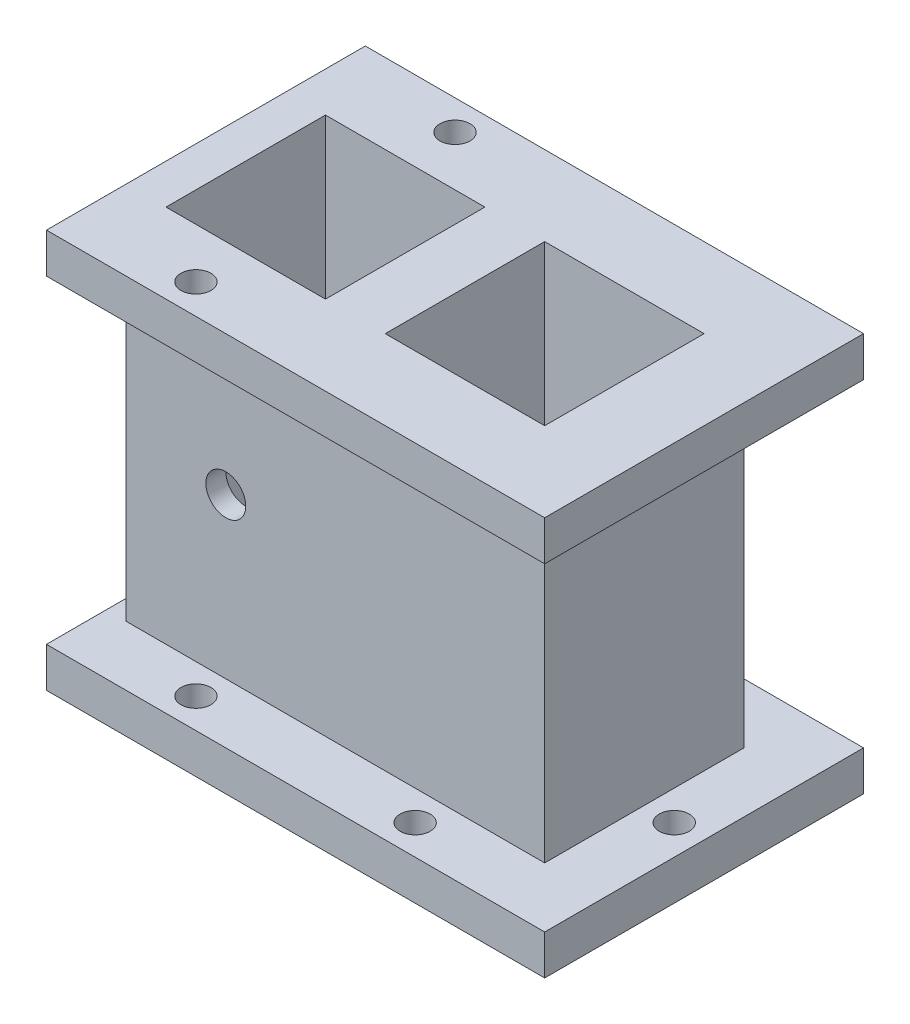
ISO-10303-21;
HEADER;
FILE_DESCRIPTION(('STEP AP214'),'2;1');
FILE_NAME('part.step','',(''),(''),'','','');
FILE_SCHEMA(('AUTOMOTIVE_DESIGN { 1 0 10303 214 1 1 1 1 }'));
ENDSEC;
DATA;
#1=APPLICATION_CONTEXT('core data for automotive mechanical design processes');
#2=APPLICATION_PROTOCOL_DEFINITION('international standard','automotive_design',2000,#1);
#3=PRODUCT_CONTEXT('',#1,'mechanical');
#4=PRODUCT('Part','Part','',(#3));
#5=PRODUCT_RELATED_PRODUCT_CATEGORY('part','',(#4));
#6=PRODUCT_DEFINITION_FORMATION('','',#4);
#7=PRODUCT_DEFINITION_CONTEXT('part definition',#1,'design');
#8=PRODUCT_DEFINITION('design','',#6,#7);
#9=PRODUCT_DEFINITION_SHAPE('','',#8);
#10=(LENGTH_UNIT() NAMED_UNIT(*) SI_UNIT(.MILLI.,.METRE.));
#11=(NAMED_UNIT(*) PLANE_ANGLE_UNIT() SI_UNIT($,.RADIAN.));
#12=(NAMED_UNIT(*) SI_UNIT($,.STERADIAN.) SOLID_ANGLE_UNIT());
#13=UNCERTAINTY_MEASURE_WITH_UNIT(LENGTH_MEASURE(1.E-05),#10,'distance_accuracy_value','');
#14=(GEOMETRIC_REPRESENTATION_CONTEXT(3) GLOBAL_UNCERTAINTY_ASSIGNED_CONTEXT((#13)) GLOBAL_UNIT_ASSIGNED_CONTEXT((#10,
#11,#12)) REPRESENTATION_CONTEXT('',''));
#15=CARTESIAN_POINT('',(0.,0.,0.));
#16=DIRECTION('',(0.,0.,1.));
#17=DIRECTION('',(1.,0.,0.));
#18=AXIS2_PLACEMENT_3D('',#15,#16,#17);
#19=CARTESIAN_POINT('',(0.0197787807074528,5.83942832277559,0.));
#20=DIRECTION('',(0.,1.,0.));
#21=DIRECTION('',(0.,0.,1.));
#22=AXIS2_PLACEMENT_3D('',#19,#20,#21);
#23=PLANE('',#22);
#24=CARTESIAN_POINT('',(-21.0304712192926,5.83942832277559,-21.05025));
#25=DIRECTION('',(0.,1.,0.));
#26=DIRECTION('',(0.,0.,1.));
#27=AXIS2_PLACEMENT_3D('',#24,#25,#26);
#28=CIRCLE('',#27,2.435352);
#29=CARTESIAN_POINT('',(-21.0304712192926,5.83942832277559,-18.614898));
#30=VERTEX_POINT('',#29);
#31=EDGE_CURVE('E355',#30,#30,#28,.F.);
#32=ORIENTED_EDGE('',*,*,#31,.T.);
#33=EDGE_LOOP('',(#32));
#34=FACE_BOUND('',#33,.T.);
#35=CARTESIAN_POINT('',(-21.0304712192926,5.83942832277559,21.05025));
#36=DIRECTION('',(0.,1.,0.));
#37=DIRECTION('',(0.,0.,1.));
#38=AXIS2_PLACEMENT_3D('',#35,#36,#37);
#39=CIRCLE('',#38,2.435352);
#40=CARTESIAN_POINT('',(-21.0304712192926,5.83942832277559,23.485602));
#41=VERTEX_POINT('',#40);
#42=EDGE_CURVE('E342',#41,#41,#39,.T.);
#43=ORIENTED_EDGE('',*,*,#42,.F.);
#44=EDGE_LOOP('',(#43));
#45=FACE_BOUND('',#44,.T.);
#46=CARTESIAN_POINT('',(14.5930287807074,5.83942832277559,-21.05025));
#47=DIRECTION('',(0.,1.,0.));
#48=DIRECTION('',(1.,0.,0.));
#49=AXIS2_PLACEMENT_3D('',#46,#47,#48);
#50=CIRCLE('',#49,2.43535200000001);
#51=CARTESIAN_POINT('',(17.0283807807074,5.83942832277559,-21.05025));
#52=VERTEX_POINT('',#51);
#53=EDGE_CURVE('E363',#52,#52,#50,.T.);
#54=ORIENTED_EDGE('',*,*,#53,.F.);
#55=EDGE_LOOP('',(#54));
#56=FACE_BOUND('',#55,.T.);
#57=CARTESIAN_POINT('',(14.5930287807077,5.83942832277559,21.05025));
#58=DIRECTION('',(0.,1.,0.));
#59=DIRECTION('',(-1.,0.,0.));
#60=AXIS2_PLACEMENT_3D('',#57,#58,#59);
#61=CIRCLE('',#60,2.43535200000001);
#62=CARTESIAN_POINT('',(12.1576767807077,5.83942832277559,21.05025));
#63=VERTEX_POINT('',#62);
#64=EDGE_CURVE('E347',#63,#63,#61,.T.);
#65=ORIENTED_EDGE('',*,*,#64,.F.);
#66=EDGE_LOOP('',(#65));
#67=FACE_BOUND('',#66,.T.);
#68=CARTESIAN_POINT('',(35.6432787807074,5.83942832277559,0.));
#69=DIRECTION('',(0.,1.,0.));
#70=DIRECTION('',(0.,0.,1.));
#71=AXIS2_PLACEMENT_3D('',#68,#69,#70);
#72=CIRCLE('',#71,2.43535200000001);
#73=CARTESIAN_POINT('',(35.6432787807074,5.83942832277559,2.43535200000001));
#74=VERTEX_POINT('',#73);
#75=EDGE_CURVE('E362',#74,#74,#72,.T.);
#76=ORIENTED_EDGE('',*,*,#75,.F.);
#77=EDGE_LOOP('',(#76));
#78=FACE_BOUND('',#77,.T.);
#79=DIRECTION('',(1.,0.,0.));
#80=VECTOR('',#79,1.);
#81=CARTESIAN_POINT('',(-40.4614712192926,5.83942832277559,25.908));
#82=LINE('',#81,#80);
#83=CARTESIAN_POINT('',(-40.4614712192926,5.83942832277559,25.908));
#84=VERTEX_POINT('',#83);
#85=CARTESIAN_POINT('',(40.5010287807074,5.83942832277559,25.908));
#86=VERTEX_POINT('',#85);
#87=EDGE_CURVE('E309',#84,#86,#82,.T.);
#88=ORIENTED_EDGE('',*,*,#87,.T.);
#89=DIRECTION('',(0.,0.,-1.));
#90=VECTOR('',#89,1.);
#91=CARTESIAN_POINT('',(40.5010287807074,5.83942832277559,25.908));
#92=LINE('',#91,#90);
#93=CARTESIAN_POINT('',(40.5010287807074,5.83942832277559,-25.908));
#94=VERTEX_POINT('',#93);
#95=EDGE_CURVE('E312',#86,#94,#92,.T.);
#96=ORIENTED_EDGE('',*,*,#95,.T.);
#97=DIRECTION('',(1.,0.,0.));
#98=VECTOR('',#97,1.);
#99=CARTESIAN_POINT('',(-40.4614712192926,5.83942832277559,-25.908));
#100=LINE('',#99,#98);
#101=CARTESIAN_POINT('',(-40.4614712192926,5.83942832277559,-25.908));
#102=VERTEX_POINT('',#101);
#103=EDGE_CURVE('E315',#102,#94,#100,.T.);
#104=ORIENTED_EDGE('',*,*,#103,.F.);
#105=DIRECTION('',(0.,0.,-1.));
#106=VECTOR('',#105,1.);
#107=CARTESIAN_POINT('',(-40.4614712192926,5.83942832277559,25.908));
#108=LINE('',#107,#106);
#109=EDGE_CURVE('E318',#84,#102,#108,.T.);
#110=ORIENTED_EDGE('',*,*,#109,.F.);
#111=EDGE_LOOP('',(#88,#96,#104,#110));
#112=FACE_BOUND('',#111,.T.);
#113=DIRECTION('',(1.,0.,0.));
#114=VECTOR('',#113,1.);
#115=CARTESIAN_POINT('',(-37.2229712192926,5.83942832277559,16.1925));
#116=LINE('',#115,#114);
#117=CARTESIAN_POINT('',(-37.2229712192926,5.83942832277559,16.1925));
#118=VERTEX_POINT('',#117);
#119=CARTESIAN_POINT('',(30.7855287807075,5.83942832277559,16.1925));
#120=VERTEX_POINT('',#119);
#121=EDGE_CURVE('E293',#118,#120,#116,.T.);
#122=ORIENTED_EDGE('',*,*,#121,.F.);
#123=DIRECTION('',(0.,0.,1.));
#124=VECTOR('',#123,1.);
#125=CARTESIAN_POINT('',(-37.2229712192926,5.83942832277559,16.1925));
#126=LINE('',#125,#124);
#127=CARTESIAN_POINT('',(-37.2229712192926,5.83942832277559,-16.1925));
#128=VERTEX_POINT('',#127);
#129=EDGE_CURVE('E276',#128,#118,#126,.T.);
#130=ORIENTED_EDGE('',*,*,#129,.F.);
#131=DIRECTION('',(-1.,0.,0.));
#132=VECTOR('',#131,1.);
#133=CARTESIAN_POINT('',(-37.2229712192926,5.83942832277559,-16.1925));
#134=LINE('',#133,#132);
#135=CARTESIAN_POINT('',(30.7855287807075,5.83942832277559,-16.1925));
#136=VERTEX_POINT('',#135);
#137=EDGE_CURVE('E281',#136,#128,#134,.T.);
#138=ORIENTED_EDGE('',*,*,#137,.F.);
#139=DIRECTION('',(0.,0.,-1.));
#140=VECTOR('',#139,1.);
#141=CARTESIAN_POINT('',(30.7855287807075,5.83942832277559,16.1925));
#142=LINE('',#141,#140);
#143=EDGE_CURVE('E295',#120,#136,#142,.T.);
#144=ORIENTED_EDGE('',*,*,#143,.F.);
#145=EDGE_LOOP('',(#122,#130,#138,#144));
#146=FACE_BOUND('',#145,.T.);
#147=ADVANCED_FACE('F36',(#34,#45,#56,#67,#78,#112,#146),#23,.T.);
#148=CARTESIAN_POINT('',(-40.4614712192926,5.83942832277559,25.908));
#149=DIRECTION('',(0.,0.,-1.));
#150=DIRECTION('',(-1.,0.,0.));
#151=AXIS2_PLACEMENT_3D('',#148,#149,#150);
#152=PLANE('',#151);
#153=DIRECTION('',(1.,0.,0.));
#154=VECTOR('',#153,1.);
#155=CARTESIAN_POINT('',(-40.4614712192926,-0.637571677224411,25.908));
#156=LINE('',#155,#154);
#157=CARTESIAN_POINT('',(-40.4614712192926,-0.637571677224411,25.908));
#158=VERTEX_POINT('',#157);
#159=CARTESIAN_POINT('',(40.5010287807074,-0.637571677224411,25.908));
#160=VERTEX_POINT('',#159);
#161=EDGE_CURVE('E308',#158,#160,#156,.T.);
#162=ORIENTED_EDGE('',*,*,#161,.T.);
#163=DIRECTION('',(0.,-1.,0.));
#164=VECTOR('',#163,1.);
#165=CARTESIAN_POINT('',(40.5010287807074,5.83942832277559,25.908));
#166=LINE('',#165,#164);
#167=EDGE_CURVE('E11',#86,#160,#166,.T.);
#168=ORIENTED_EDGE('',*,*,#167,.F.);
#169=ORIENTED_EDGE('',*,*,#87,.F.);
#170=DIRECTION('',(0.,-1.,0.));
#171=VECTOR('',#170,1.);
#172=CARTESIAN_POINT('',(-40.4614712192926,5.83942832277559,25.908));
#173=LINE('',#172,#171);
#174=EDGE_CURVE('E321',#84,#158,#173,.T.);
#175=ORIENTED_EDGE('',*,*,#174,.T.);
#176=EDGE_LOOP('',(#162,#168,#169,#175));
#177=FACE_BOUND('',#176,.T.);
#178=ADVANCED_FACE('F38',(#177),#152,.F.);
#179=CARTESIAN_POINT('',(40.5010287807074,5.83942832277559,25.908));
#180=DIRECTION('',(-1.,0.,0.));
#181=DIRECTION('',(0.,0.,1.));
#182=AXIS2_PLACEMENT_3D('',#179,#180,#181);
#183=PLANE('',#182);
#184=DIRECTION('',(0.,0.,-1.));
#185=VECTOR('',#184,1.);
#186=CARTESIAN_POINT('',(40.5010287807074,-0.637571677224411,25.908));
#187=LINE('',#186,#185);
#188=CARTESIAN_POINT('',(40.5010287807074,-0.637571677224411,-25.908));
#189=VERTEX_POINT('',#188);
#190=EDGE_CURVE('E324',#160,#189,#187,.T.);
#191=ORIENTED_EDGE('',*,*,#190,.T.);
#192=DIRECTION('',(0.,-1.,0.));
#193=VECTOR('',#192,1.);
#194=CARTESIAN_POINT('',(40.5010287807074,5.83942832277559,-25.908));
#195=LINE('',#194,#193);
#196=EDGE_CURVE('E45',#94,#189,#195,.T.);
#197=ORIENTED_EDGE('',*,*,#196,.F.);
#198=ORIENTED_EDGE('',*,*,#95,.F.);
#199=ORIENTED_EDGE('',*,*,#167,.T.);
#200=EDGE_LOOP('',(#191,#197,#198,#199));
#201=FACE_BOUND('',#200,.T.);
#202=ADVANCED_FACE('F410',(#201),#183,.F.);
#203=CARTESIAN_POINT('',(-40.4614712192926,5.83942832277559,-25.908));
#204=DIRECTION('',(0.,0.,-1.));
#205=DIRECTION('',(-1.,0.,0.));
#206=AXIS2_PLACEMENT_3D('',#203,#204,#205);
#207=PLANE('',#206);
#208=DIRECTION('',(1.,0.,0.));
#209=VECTOR('',#208,1.);
#210=CARTESIAN_POINT('',(-40.4614712192926,-0.637571677224411,-25.908));
#211=LINE('',#210,#209);
#212=CARTESIAN_POINT('',(-40.4614712192926,-0.637571677224411,-25.908));
#213=VERTEX_POINT('',#212);
#214=EDGE_CURVE('E327',#213,#189,#211,.T.);
#215=ORIENTED_EDGE('',*,*,#214,.F.);
#216=DIRECTION('',(0.,-1.,0.));
#217=VECTOR('',#216,1.);
#218=CARTESIAN_POINT('',(-40.4614712192926,5.83942832277559,-25.908));
#219=LINE('',#218,#217);
#220=EDGE_CURVE('E333',#102,#213,#219,.T.);
#221=ORIENTED_EDGE('',*,*,#220,.F.);
#222=ORIENTED_EDGE('',*,*,#103,.T.);
#223=ORIENTED_EDGE('',*,*,#196,.T.);
#224=EDGE_LOOP('',(#215,#221,#222,#223));
#225=FACE_BOUND('',#224,.T.);
#226=ADVANCED_FACE('F407',(#225),#207,.T.);
#227=CARTESIAN_POINT('',(-40.4614712192926,5.83942832277559,25.908));
#228=DIRECTION('',(-1.,0.,0.));
#229=DIRECTION('',(0.,0.,1.));
#230=AXIS2_PLACEMENT_3D('',#227,#228,#229);
#231=PLANE('',#230);
#232=DIRECTION('',(0.,0.,-1.));
#233=VECTOR('',#232,1.);
#234=CARTESIAN_POINT('',(-40.4614712192926,-0.637571677224411,25.908));
#235=LINE('',#234,#233);
#236=EDGE_CURVE('E313',#158,#213,#235,.T.);
#237=ORIENTED_EDGE('',*,*,#236,.F.);
#238=ORIENTED_EDGE('',*,*,#174,.F.);
#239=ORIENTED_EDGE('',*,*,#109,.T.);
#240=ORIENTED_EDGE('',*,*,#220,.T.);
#241=EDGE_LOOP('',(#237,#238,#239,#240));
#242=FACE_BOUND('',#241,.T.);
#243=ADVANCED_FACE('F392',(#242),#231,.T.);
#244=CARTESIAN_POINT('',(0.0197787807074528,-0.637571677224411,0.));
#245=DIRECTION('',(0.,1.,0.));
#246=DIRECTION('',(0.,0.,1.));
#247=AXIS2_PLACEMENT_3D('',#244,#245,#246);
#248=PLANE('',#247);
#249=CARTESIAN_POINT('',(-21.0304712192926,-0.637571677224411,-21.05025));
#250=DIRECTION('',(0.,-1.,0.));
#251=DIRECTION('',(0.,0.,-1.));
#252=AXIS2_PLACEMENT_3D('',#249,#250,#251);
#253=CIRCLE('',#252,2.435352);
#254=CARTESIAN_POINT('',(-21.0304712192926,-0.637571677224411,-23.485602));
#255=VERTEX_POINT('',#254);
#256=EDGE_CURVE('E729',#255,#255,#253,.T.);
#257=ORIENTED_EDGE('',*,*,#256,.F.);
#258=EDGE_LOOP('',(#257));
#259=FACE_BOUND('',#258,.T.);
#260=CARTESIAN_POINT('',(-21.0304712192926,-0.637571677224411,21.05025));
#261=DIRECTION('',(0.,1.,0.));
#262=DIRECTION('',(0.,0.,1.));
#263=AXIS2_PLACEMENT_3D('',#260,#261,#262);
#264=CIRCLE('',#263,2.435352);
#265=CARTESIAN_POINT('',(-21.0304712192926,-0.637571677224411,23.485602));
#266=VERTEX_POINT('',#265);
#267=EDGE_CURVE('E343',#266,#266,#264,.T.);
#268=ORIENTED_EDGE('',*,*,#267,.T.);
#269=EDGE_LOOP('',(#268));
#270=FACE_BOUND('',#269,.T.);
#271=CARTESIAN_POINT('',(14.5930287807074,-0.637571677224411,-21.05025));
#272=DIRECTION('',(0.,1.,0.));
#273=DIRECTION('',(1.,0.,0.));
#274=AXIS2_PLACEMENT_3D('',#271,#272,#273);
#275=CIRCLE('',#274,2.43535200000001);
#276=CARTESIAN_POINT('',(17.0283807807074,-0.637571677224411,-21.05025));
#277=VERTEX_POINT('',#276);
#278=EDGE_CURVE('E359',#277,#277,#275,.T.);
#279=ORIENTED_EDGE('',*,*,#278,.T.);
#280=EDGE_LOOP('',(#279));
#281=FACE_BOUND('',#280,.T.);
#282=CARTESIAN_POINT('',(14.5930287807077,-0.637571677224411,21.05025));
#283=DIRECTION('',(0.,1.,0.));
#284=DIRECTION('',(-1.,0.,0.));
#285=AXIS2_PLACEMENT_3D('',#282,#283,#284);
#286=CIRCLE('',#285,2.43535200000001);
#287=CARTESIAN_POINT('',(12.1576767807077,-0.637571677224411,21.05025));
#288=VERTEX_POINT('',#287);
#289=EDGE_CURVE('E366',#288,#288,#286,.T.);
#290=ORIENTED_EDGE('',*,*,#289,.T.);
#291=EDGE_LOOP('',(#290));
#292=FACE_BOUND('',#291,.T.);
#293=CARTESIAN_POINT('',(35.6432787807074,-0.637571677224411,0.));
#294=DIRECTION('',(0.,1.,0.));
#295=DIRECTION('',(0.,0.,1.));
#296=AXIS2_PLACEMENT_3D('',#293,#294,#295);
#297=CIRCLE('',#296,2.43535200000001);
#298=CARTESIAN_POINT('',(35.6432787807074,-0.637571677224411,2.43535200000001));
#299=VERTEX_POINT('',#298);
#300=EDGE_CURVE('E371',#299,#299,#297,.T.);
#301=ORIENTED_EDGE('',*,*,#300,.T.);
#302=EDGE_LOOP('',(#301));
#303=FACE_BOUND('',#302,.T.);
#304=DIRECTION('',(-1.,0.,0.));
#305=VECTOR('',#304,1.);
#306=CARTESIAN_POINT('',(-33.9844712192926,-0.637571677224411,-12.954));
#307=LINE('',#306,#305);
#308=CARTESIAN_POINT('',(-8.07647121929256,-0.637571677224411,-12.954));
#309=VERTEX_POINT('',#308);
#310=CARTESIAN_POINT('',(-33.9844712192926,-0.637571677224411,-12.954));
#311=VERTEX_POINT('',#310);
#312=EDGE_CURVE('E208',#309,#311,#307,.T.);
#313=ORIENTED_EDGE('',*,*,#312,.T.);
#314=DIRECTION('',(0.,0.,1.));
#315=VECTOR('',#314,1.);
#316=CARTESIAN_POINT('',(-33.9844712192926,-0.637571677224411,-12.954));
#317=LINE('',#316,#315);
#318=CARTESIAN_POINT('',(-33.9844712192926,-0.637571677224411,12.954));
#319=VERTEX_POINT('',#318);
#320=EDGE_CURVE('E199',#311,#319,#317,.T.);
#321=ORIENTED_EDGE('',*,*,#320,.T.);
#322=DIRECTION('',(1.,0.,0.));
#323=VECTOR('',#322,1.);
#324=CARTESIAN_POINT('',(-33.9844712192926,-0.637571677224411,12.954));
#325=LINE('',#324,#323);
#326=CARTESIAN_POINT('',(-8.07647121929256,-0.637571677224411,12.954));
#327=VERTEX_POINT('',#326);
#328=EDGE_CURVE('E205',#319,#327,#325,.T.);
#329=ORIENTED_EDGE('',*,*,#328,.T.);
#330=DIRECTION('',(0.,0.,-1.));
#331=VECTOR('',#330,1.);
#332=CARTESIAN_POINT('',(-8.07647121929256,-0.637571677224411,-12.954));
#333=LINE('',#332,#331);
#334=EDGE_CURVE('E181',#327,#309,#333,.T.);
#335=ORIENTED_EDGE('',*,*,#334,.T.);
#336=EDGE_LOOP('',(#313,#321,#329,#335));
#337=FACE_BOUND('',#336,.T.);
#338=DIRECTION('',(-1.,0.,0.));
#339=VECTOR('',#338,1.);
#340=CARTESIAN_POINT('',(1.63902878070744,-0.637571677224411,-12.954));
#341=LINE('',#340,#339);
#342=CARTESIAN_POINT('',(27.5470287807074,-0.637571677224411,-12.954));
#343=VERTEX_POINT('',#342);
#344=CARTESIAN_POINT('',(1.63902878070744,-0.637571677224411,-12.954));
#345=VERTEX_POINT('',#344);
#346=EDGE_CURVE('E233',#343,#345,#341,.T.);
#347=ORIENTED_EDGE('',*,*,#346,.T.);
#348=DIRECTION('',(0.,0.,1.));
#349=VECTOR('',#348,1.);
#350=CARTESIAN_POINT('',(1.63902878070744,-0.637571677224411,-12.954));
#351=LINE('',#350,#349);
#352=CARTESIAN_POINT('',(1.63902878070744,-0.637571677224411,12.954));
#353=VERTEX_POINT('',#352);
#354=EDGE_CURVE('E224',#345,#353,#351,.T.);
#355=ORIENTED_EDGE('',*,*,#354,.T.);
#356=DIRECTION('',(1.,0.,0.));
#357=VECTOR('',#356,1.);
#358=CARTESIAN_POINT('',(1.63902878070744,-0.637571677224411,12.954));
#359=LINE('',#358,#357);
#360=CARTESIAN_POINT('',(27.5470287807074,-0.637571677224411,12.954));
#361=VERTEX_POINT('',#360);
#362=EDGE_CURVE('E227',#353,#361,#359,.T.);
#363=ORIENTED_EDGE('',*,*,#362,.T.);
#364=DIRECTION('',(0.,0.,-1.));
#365=VECTOR('',#364,1.);
#366=CARTESIAN_POINT('',(27.5470287807074,-0.637571677224411,-12.954));
#367=LINE('',#366,#365);
#368=EDGE_CURVE('E230',#361,#343,#367,.T.);
#369=ORIENTED_EDGE('',*,*,#368,.T.);
#370=EDGE_LOOP('',(#347,#355,#363,#369));
#371=FACE_BOUND('',#370,.T.);
#372=ORIENTED_EDGE('',*,*,#161,.F.);
#373=ORIENTED_EDGE('',*,*,#236,.T.);
#374=ORIENTED_EDGE('',*,*,#214,.T.);
#375=ORIENTED_EDGE('',*,*,#190,.F.);
#376=EDGE_LOOP('',(#372,#373,#374,#375));
#377=FACE_BOUND('',#376,.T.);
#378=ADVANCED_FACE('F388',(#259,#270,#281,#292,#303,#337,#371,#377),#248,.F.);
#379=CARTESIAN_POINT('',(-37.2229712192926,57.6554283227756,16.1925));
#380=DIRECTION('',(1.,0.,0.));
#381=DIRECTION('',(0.,0.,-1.));
#382=AXIS2_PLACEMENT_3D('',#379,#380,#381);
#383=PLANE('',#382);
#384=ORIENTED_EDGE('',*,*,#129,.T.);
#385=DIRECTION('',(0.,-1.,0.));
#386=VECTOR('',#385,1.);
#387=CARTESIAN_POINT('',(-37.2229712192926,57.6554283227756,16.1925));
#388=LINE('',#387,#386);
#389=CARTESIAN_POINT('',(-37.2229712192926,57.6554283227756,16.1925));
#390=VERTEX_POINT('',#389);
#391=EDGE_CURVE('E306',#390,#118,#388,.T.);
#392=ORIENTED_EDGE('',*,*,#391,.F.);
#393=DIRECTION('',(0.,0.,1.));
#394=VECTOR('',#393,1.);
#395=CARTESIAN_POINT('',(-37.2229712192926,57.6554283227756,16.1925));
#396=LINE('',#395,#394);
#397=CARTESIAN_POINT('',(-37.2229712192926,57.6554283227756,-16.1925));
#398=VERTEX_POINT('',#397);
#399=EDGE_CURVE('E277',#398,#390,#396,.T.);
#400=ORIENTED_EDGE('',*,*,#399,.F.);
#401=DIRECTION('',(0.,-1.,0.));
#402=VECTOR('',#401,1.);
#403=CARTESIAN_POINT('',(-37.2229712192926,57.6554283227756,-16.1925));
#404=LINE('',#403,#402);
#405=EDGE_CURVE('E290',#398,#128,#404,.T.);
#406=ORIENTED_EDGE('',*,*,#405,.T.);
#407=EDGE_LOOP('',(#384,#392,#400,#406));
#408=FACE_BOUND('',#407,.T.);
#409=ADVANCED_FACE('F391',(#408),#383,.F.);
#410=CARTESIAN_POINT('',(-37.2229712192926,57.6554283227756,16.1925));
#411=DIRECTION('',(0.,0.,-1.));
#412=DIRECTION('',(-1.,0.,0.));
#413=AXIS2_PLACEMENT_3D('',#410,#411,#412);
#414=PLANE('',#413);
#415=CARTESIAN_POINT('',(-21.0304712192926,31.7474283227756,16.1925));
#416=DIRECTION('',(0.,0.,1.));
#417=DIRECTION('',(1.,0.,0.));
#418=AXIS2_PLACEMENT_3D('',#415,#416,#417);
#419=CIRCLE('',#418,3.2385);
#420=CARTESIAN_POINT('',(-17.7919712192926,31.7474283227756,16.1925));
#421=VERTEX_POINT('',#420);
#422=EDGE_CURVE('E339',#421,#421,#419,.T.);
#423=ORIENTED_EDGE('',*,*,#422,.F.);
#424=EDGE_LOOP('',(#423));
#425=FACE_BOUND('',#424,.T.);
#426=ORIENTED_EDGE('',*,*,#121,.T.);
#427=DIRECTION('',(0.,-1.,0.));
#428=VECTOR('',#427,1.);
#429=CARTESIAN_POINT('',(30.7855287807075,57.6554283227756,16.1925));
#430=LINE('',#429,#428);
#431=CARTESIAN_POINT('',(30.7855287807075,57.6554283227756,16.1925));
#432=VERTEX_POINT('',#431);
#433=EDGE_CURVE('E303',#432,#120,#430,.T.);
#434=ORIENTED_EDGE('',*,*,#433,.F.);
#435=DIRECTION('',(1.,0.,0.));
#436=VECTOR('',#435,1.);
#437=CARTESIAN_POINT('',(-37.2229712192926,57.6554283227756,16.1925));
#438=LINE('',#437,#436);
#439=EDGE_CURVE('E280',#390,#432,#438,.T.);
#440=ORIENTED_EDGE('',*,*,#439,.F.);
#441=ORIENTED_EDGE('',*,*,#391,.T.);
#442=EDGE_LOOP('',(#426,#434,#440,#441));
#443=FACE_BOUND('',#442,.T.);
#444=ADVANCED_FACE('F421',(#425,#443),#414,.F.);
#445=CARTESIAN_POINT('',(30.7855287807075,57.6554283227756,16.1925));
#446=DIRECTION('',(-1.,0.,0.));
#447=DIRECTION('',(0.,0.,1.));
#448=AXIS2_PLACEMENT_3D('',#445,#446,#447);
#449=PLANE('',#448);
#450=ORIENTED_EDGE('',*,*,#143,.T.);
#451=DIRECTION('',(0.,-1.,0.));
#452=VECTOR('',#451,1.);
#453=CARTESIAN_POINT('',(30.7855287807075,57.6554283227756,-16.1925));
#454=LINE('',#453,#452);
#455=CARTESIAN_POINT('',(30.7855287807075,57.6554283227756,-16.1925));
#456=VERTEX_POINT('',#455);
#457=EDGE_CURVE('E301',#456,#136,#454,.T.);
#458=ORIENTED_EDGE('',*,*,#457,.F.);
#459=DIRECTION('',(0.,0.,-1.));
#460=VECTOR('',#459,1.);
#461=CARTESIAN_POINT('',(30.7855287807075,57.6554283227756,16.1925));
#462=LINE('',#461,#460);
#463=EDGE_CURVE('E284',#432,#456,#462,.T.);
#464=ORIENTED_EDGE('',*,*,#463,.F.);
#465=ORIENTED_EDGE('',*,*,#433,.T.);
#466=EDGE_LOOP('',(#450,#458,#464,#465));
#467=FACE_BOUND('',#466,.T.);
#468=ADVANCED_FACE('F425',(#467),#449,.F.);
#469=CARTESIAN_POINT('',(-37.2229712192926,57.6554283227756,-16.1925));
#470=DIRECTION('',(0.,0.,1.));
#471=DIRECTION('',(1.,0.,0.));
#472=AXIS2_PLACEMENT_3D('',#469,#470,#471);
#473=PLANE('',#472);
#474=CARTESIAN_POINT('',(-21.0304712192926,31.7474283227756,-16.1925));
#475=DIRECTION('',(0.,0.,1.));
#476=DIRECTION('',(1.,0.,0.));
#477=AXIS2_PLACEMENT_3D('',#474,#475,#476);
#478=CIRCLE('',#477,3.2385);
#479=CARTESIAN_POINT('',(-17.7919712192926,31.7474283227756,-16.1925));
#480=VERTEX_POINT('',#479);
#481=EDGE_CURVE('E216',#480,#480,#478,.T.);
#482=ORIENTED_EDGE('',*,*,#481,.T.);
#483=EDGE_LOOP('',(#482));
#484=FACE_BOUND('',#483,.T.);
#485=ORIENTED_EDGE('',*,*,#137,.T.);
#486=ORIENTED_EDGE('',*,*,#405,.F.);
#487=DIRECTION('',(-1.,0.,0.));
#488=VECTOR('',#487,1.);
#489=CARTESIAN_POINT('',(-37.2229712192926,57.6554283227756,-16.1925));
#490=LINE('',#489,#488);
#491=EDGE_CURVE('E287',#456,#398,#490,.T.);
#492=ORIENTED_EDGE('',*,*,#491,.F.);
#493=ORIENTED_EDGE('',*,*,#457,.T.);
#494=EDGE_LOOP('',(#485,#486,#492,#493));
#495=FACE_BOUND('',#494,.T.);
#496=ADVANCED_FACE('F433',(#484,#495),#473,.F.);
#497=CARTESIAN_POINT('',(0.0197787807074528,64.1324283227756,0.));
#498=DIRECTION('',(0.,-1.,0.));
#499=DIRECTION('',(0.,0.,1.));
#500=AXIS2_PLACEMENT_3D('',#497,#498,#499);
#501=PLANE('',#500);
#502=CARTESIAN_POINT('',(-21.0304712192926,64.1324283227756,-21.05025));
#503=DIRECTION('',(0.,-1.,0.));
#504=DIRECTION('',(0.,0.,-1.));
#505=AXIS2_PLACEMENT_3D('',#502,#503,#504);
#506=CIRCLE('',#505,2.435352);
#507=CARTESIAN_POINT('',(-21.0304712192926,64.1324283227756,-23.485602));
#508=VERTEX_POINT('',#507);
#509=EDGE_CURVE('E730',#508,#508,#506,.T.);
#510=ORIENTED_EDGE('',*,*,#509,.T.);
#511=EDGE_LOOP('',(#510));
#512=FACE_BOUND('',#511,.T.);
#513=CARTESIAN_POINT('',(-21.0304712192926,64.1324283227756,21.05025));
#514=DIRECTION('',(0.,1.,0.));
#515=DIRECTION('',(0.,0.,1.));
#516=AXIS2_PLACEMENT_3D('',#513,#514,#515);
#517=CIRCLE('',#516,2.435352);
#518=CARTESIAN_POINT('',(-21.0304712192926,64.1324283227756,23.485602));
#519=VERTEX_POINT('',#518);
#520=EDGE_CURVE('E350',#519,#519,#517,.T.);
#521=ORIENTED_EDGE('',*,*,#520,.F.);
#522=EDGE_LOOP('',(#521));
#523=FACE_BOUND('',#522,.T.);
#524=DIRECTION('',(1.,0.,0.));
#525=VECTOR('',#524,1.);
#526=CARTESIAN_POINT('',(-33.9844712192926,64.1324283227756,12.954));
#527=LINE('',#526,#525);
#528=CARTESIAN_POINT('',(-33.9844712192926,64.1324283227756,12.954));
#529=VERTEX_POINT('',#528);
#530=CARTESIAN_POINT('',(-8.07647121929256,64.1324283227756,12.954));
#531=VERTEX_POINT('',#530);
#532=EDGE_CURVE('E187',#529,#531,#527,.T.);
#533=ORIENTED_EDGE('',*,*,#532,.F.);
#534=DIRECTION('',(0.,0.,1.));
#535=VECTOR('',#534,1.);
#536=CARTESIAN_POINT('',(-33.9844712192926,64.1324283227756,-12.954));
#537=LINE('',#536,#535);
#538=CARTESIAN_POINT('',(-33.9844712192926,64.1324283227756,-12.954));
#539=VERTEX_POINT('',#538);
#540=EDGE_CURVE('E192',#539,#529,#537,.T.);
#541=ORIENTED_EDGE('',*,*,#540,.F.);
#542=DIRECTION('',(-1.,0.,0.));
#543=VECTOR('',#542,1.);
#544=CARTESIAN_POINT('',(-33.9844712192926,64.1324283227756,-12.954));
#545=LINE('',#544,#543);
#546=CARTESIAN_POINT('',(-8.07647121929256,64.1324283227756,-12.954));
#547=VERTEX_POINT('',#546);
#548=EDGE_CURVE('E197',#547,#539,#545,.T.);
#549=ORIENTED_EDGE('',*,*,#548,.F.);
#550=DIRECTION('',(0.,0.,-1.));
#551=VECTOR('',#550,1.);
#552=CARTESIAN_POINT('',(-8.07647121929256,64.1324283227756,-12.954));
#553=LINE('',#552,#551);
#554=EDGE_CURVE('E178',#531,#547,#553,.T.);
#555=ORIENTED_EDGE('',*,*,#554,.F.);
#556=EDGE_LOOP('',(#533,#541,#549,#555));
#557=FACE_BOUND('',#556,.T.);
#558=DIRECTION('',(1.,0.,0.));
#559=VECTOR('',#558,1.);
#560=CARTESIAN_POINT('',(1.63902878070744,64.1324283227756,12.954));
#561=LINE('',#560,#559);
#562=CARTESIAN_POINT('',(1.63902878070744,64.1324283227756,12.954));
#563=VERTEX_POINT('',#562);
#564=CARTESIAN_POINT('',(27.5470287807074,64.1324283227756,12.954));
#565=VERTEX_POINT('',#564);
#566=EDGE_CURVE('E215',#563,#565,#561,.T.);
#567=ORIENTED_EDGE('',*,*,#566,.F.);
#568=DIRECTION('',(0.,0.,1.));
#569=VECTOR('',#568,1.);
#570=CARTESIAN_POINT('',(1.63902878070744,64.1324283227756,-12.954));
#571=LINE('',#570,#569);
#572=CARTESIAN_POINT('',(1.63902878070744,64.1324283227756,-12.954));
#573=VERTEX_POINT('',#572);
#574=EDGE_CURVE('E212',#573,#563,#571,.T.);
#575=ORIENTED_EDGE('',*,*,#574,.F.);
#576=DIRECTION('',(-1.,0.,0.));
#577=VECTOR('',#576,1.);
#578=CARTESIAN_POINT('',(1.63902878070744,64.1324283227756,-12.954));
#579=LINE('',#578,#577);
#580=CARTESIAN_POINT('',(27.5470287807074,64.1324283227756,-12.954));
#581=VERTEX_POINT('',#580);
#582=EDGE_CURVE('E221',#581,#573,#579,.T.);
#583=ORIENTED_EDGE('',*,*,#582,.F.);
#584=DIRECTION('',(0.,0.,-1.));
#585=VECTOR('',#584,1.);
#586=CARTESIAN_POINT('',(27.5470287807074,64.1324283227756,-12.954));
#587=LINE('',#586,#585);
#588=EDGE_CURVE('E218',#565,#581,#587,.T.);
#589=ORIENTED_EDGE('',*,*,#588,.F.);
#590=EDGE_LOOP('',(#567,#575,#583,#589));
#591=FACE_BOUND('',#590,.T.);
#592=DIRECTION('',(1.,0.,0.));
#593=VECTOR('',#592,1.);
#594=CARTESIAN_POINT('',(-40.4614712192926,64.1324283227756,25.908));
#595=LINE('',#594,#593);
#596=CARTESIAN_POINT('',(-40.4614712192926,64.1324283227756,25.908));
#597=VERTEX_POINT('',#596);
#598=CARTESIAN_POINT('',(40.5010287807074,64.1324283227756,25.908));
#599=VERTEX_POINT('',#598);
#600=EDGE_CURVE('E211',#597,#599,#595,.T.);
#601=ORIENTED_EDGE('',*,*,#600,.T.);
#602=DIRECTION('',(0.,0.,-1.));
#603=VECTOR('',#602,1.);
#604=CARTESIAN_POINT('',(40.5010287807074,64.1324283227756,25.908));
#605=LINE('',#604,#603);
#606=CARTESIAN_POINT('',(40.5010287807074,64.1324283227756,-25.908));
#607=VERTEX_POINT('',#606);
#608=EDGE_CURVE('E240',#599,#607,#605,.T.);
#609=ORIENTED_EDGE('',*,*,#608,.T.);
#610=DIRECTION('',(1.,0.,0.));
#611=VECTOR('',#610,1.);
#612=CARTESIAN_POINT('',(-40.4614712192926,64.1324283227756,-25.908));
#613=LINE('',#612,#611);
#614=CARTESIAN_POINT('',(-40.4614712192926,64.1324283227756,-25.908));
#615=VERTEX_POINT('',#614);
#616=EDGE_CURVE('E252',#615,#607,#613,.T.);
#617=ORIENTED_EDGE('',*,*,#616,.F.);
#618=DIRECTION('',(0.,0.,-1.));
#619=VECTOR('',#618,1.);
#620=CARTESIAN_POINT('',(-40.4614712192926,64.1324283227756,25.908));
#621=LINE('',#620,#619);
#622=EDGE_CURVE('E250',#597,#615,#621,.T.);
#623=ORIENTED_EDGE('',*,*,#622,.F.);
#624=EDGE_LOOP('',(#601,#609,#617,#623));
#625=FACE_BOUND('',#624,.T.);
#626=ADVANCED_FACE('F194',(#512,#523,#557,#591,#625),#501,.F.);
#627=CARTESIAN_POINT('',(0.0197787807074528,57.6554283227756,0.));
#628=DIRECTION('',(0.,-1.,0.));
#629=DIRECTION('',(0.,0.,1.));
#630=AXIS2_PLACEMENT_3D('',#627,#628,#629);
#631=PLANE('',#630);
#632=CARTESIAN_POINT('',(-21.0304712192926,57.6554283227756,-21.05025));
#633=DIRECTION('',(0.,-1.,0.));
#634=DIRECTION('',(0.,0.,-1.));
#635=AXIS2_PLACEMENT_3D('',#632,#633,#634);
#636=CIRCLE('',#635,2.435352);
#637=CARTESIAN_POINT('',(-21.0304712192926,57.6554283227756,-23.485602));
#638=VERTEX_POINT('',#637);
#639=EDGE_CURVE('E40',#638,#638,#636,.F.);
#640=ORIENTED_EDGE('',*,*,#639,.T.);
#641=EDGE_LOOP('',(#640));
#642=FACE_BOUND('',#641,.T.);
#643=CARTESIAN_POINT('',(-21.0304712192926,57.6554283227756,21.05025));
#644=DIRECTION('',(0.,-1.,0.));
#645=DIRECTION('',(0.,0.,-1.));
#646=AXIS2_PLACEMENT_3D('',#643,#644,#645);
#647=CIRCLE('',#646,2.435352);
#648=CARTESIAN_POINT('',(-21.0304712192926,57.6554283227756,18.614898));
#649=VERTEX_POINT('',#648);
#650=EDGE_CURVE('E340',#649,#649,#647,.T.);
#651=ORIENTED_EDGE('',*,*,#650,.F.);
#652=EDGE_LOOP('',(#651));
#653=FACE_BOUND('',#652,.T.);
#654=ORIENTED_EDGE('',*,*,#491,.T.);
#655=ORIENTED_EDGE('',*,*,#399,.T.);
#656=ORIENTED_EDGE('',*,*,#439,.T.);
#657=ORIENTED_EDGE('',*,*,#463,.T.);
#658=EDGE_LOOP('',(#654,#655,#656,#657));
#659=FACE_BOUND('',#658,.T.);
#660=DIRECTION('',(1.,0.,0.));
#661=VECTOR('',#660,1.);
#662=CARTESIAN_POINT('',(-40.4614712192926,57.6554283227756,25.908));
#663=LINE('',#662,#661);
#664=CARTESIAN_POINT('',(-40.4614712192926,57.6554283227756,25.908));
#665=VERTEX_POINT('',#664);
#666=CARTESIAN_POINT('',(40.5010287807074,57.6554283227756,25.908));
#667=VERTEX_POINT('',#666);
#668=EDGE_CURVE('E236',#665,#667,#663,.T.);
#669=ORIENTED_EDGE('',*,*,#668,.F.);
#670=DIRECTION('',(0.,0.,-1.));
#671=VECTOR('',#670,1.);
#672=CARTESIAN_POINT('',(-40.4614712192926,57.6554283227756,25.908));
#673=LINE('',#672,#671);
#674=CARTESIAN_POINT('',(-40.4614712192926,57.6554283227756,-25.908));
#675=VERTEX_POINT('',#674);
#676=EDGE_CURVE('E239',#665,#675,#673,.T.);
#677=ORIENTED_EDGE('',*,*,#676,.T.);
#678=DIRECTION('',(1.,0.,0.));
#679=VECTOR('',#678,1.);
#680=CARTESIAN_POINT('',(-40.4614712192926,57.6554283227756,-25.908));
#681=LINE('',#680,#679);
#682=CARTESIAN_POINT('',(40.5010287807074,57.6554283227756,-25.908));
#683=VERTEX_POINT('',#682);
#684=EDGE_CURVE('E242',#675,#683,#681,.T.);
#685=ORIENTED_EDGE('',*,*,#684,.T.);
#686=DIRECTION('',(0.,0.,-1.));
#687=VECTOR('',#686,1.);
#688=CARTESIAN_POINT('',(40.5010287807074,57.6554283227756,25.908));
#689=LINE('',#688,#687);
#690=EDGE_CURVE('E244',#667,#683,#689,.T.);
#691=ORIENTED_EDGE('',*,*,#690,.F.);
#692=EDGE_LOOP('',(#669,#677,#685,#691));
#693=FACE_BOUND('',#692,.T.);
#694=ADVANCED_FACE('F428',(#642,#653,#659,#693),#631,.T.);
#695=CARTESIAN_POINT('',(40.5010287807074,57.6554283227756,25.908));
#696=DIRECTION('',(1.,0.,0.));
#697=DIRECTION('',(0.,0.,-1.));
#698=AXIS2_PLACEMENT_3D('',#695,#696,#697);
#699=PLANE('',#698);
#700=ORIENTED_EDGE('',*,*,#608,.F.);
#701=DIRECTION('',(0.,1.,0.));
#702=VECTOR('',#701,1.);
#703=CARTESIAN_POINT('',(40.5010287807074,57.6554283227756,25.908));
#704=LINE('',#703,#702);
#705=EDGE_CURVE('E247',#667,#599,#704,.T.);
#706=ORIENTED_EDGE('',*,*,#705,.F.);
#707=ORIENTED_EDGE('',*,*,#690,.T.);
#708=DIRECTION('',(0.,1.,0.));
#709=VECTOR('',#708,1.);
#710=CARTESIAN_POINT('',(40.5010287807074,57.6554283227756,-25.908));
#711=LINE('',#710,#709);
#712=EDGE_CURVE('E258',#683,#607,#711,.T.);
#713=ORIENTED_EDGE('',*,*,#712,.T.);
#714=EDGE_LOOP('',(#700,#706,#707,#713));
#715=FACE_BOUND('',#714,.T.);
#716=ADVANCED_FACE('F587',(#715),#699,.T.);
#717=CARTESIAN_POINT('',(-40.4614712192926,57.6554283227756,-25.908));
#718=DIRECTION('',(0.,0.,1.));
#719=DIRECTION('',(1.,0.,0.));
#720=AXIS2_PLACEMENT_3D('',#717,#718,#719);
#721=PLANE('',#720);
#722=ORIENTED_EDGE('',*,*,#616,.T.);
#723=ORIENTED_EDGE('',*,*,#712,.F.);
#724=ORIENTED_EDGE('',*,*,#684,.F.);
#725=DIRECTION('',(0.,1.,0.));
#726=VECTOR('',#725,1.);
#727=CARTESIAN_POINT('',(-40.4614712192926,57.6554283227756,-25.908));
#728=LINE('',#727,#726);
#729=EDGE_CURVE('E260',#675,#615,#728,.T.);
#730=ORIENTED_EDGE('',*,*,#729,.T.);
#731=EDGE_LOOP('',(#722,#723,#724,#730));
#732=FACE_BOUND('',#731,.T.);
#733=ADVANCED_FACE('F596',(#732),#721,.F.);
#734=CARTESIAN_POINT('',(-40.4614712192926,57.6554283227756,25.908));
#735=DIRECTION('',(1.,0.,0.));
#736=DIRECTION('',(0.,0.,-1.));
#737=AXIS2_PLACEMENT_3D('',#734,#735,#736);
#738=PLANE('',#737);
#739=ORIENTED_EDGE('',*,*,#622,.T.);
#740=ORIENTED_EDGE('',*,*,#729,.F.);
#741=ORIENTED_EDGE('',*,*,#676,.F.);
#742=DIRECTION('',(0.,1.,0.));
#743=VECTOR('',#742,1.);
#744=CARTESIAN_POINT('',(-40.4614712192926,57.6554283227756,25.908));
#745=LINE('',#744,#743);
#746=EDGE_CURVE('E263',#665,#597,#745,.T.);
#747=ORIENTED_EDGE('',*,*,#746,.T.);
#748=EDGE_LOOP('',(#739,#740,#741,#747));
#749=FACE_BOUND('',#748,.T.);
#750=ADVANCED_FACE('F605',(#749),#738,.F.);
#751=CARTESIAN_POINT('',(-40.4614712192926,57.6554283227756,25.908));
#752=DIRECTION('',(0.,0.,1.));
#753=DIRECTION('',(1.,0.,0.));
#754=AXIS2_PLACEMENT_3D('',#751,#752,#753);
#755=PLANE('',#754);
#756=ORIENTED_EDGE('',*,*,#600,.F.);
#757=ORIENTED_EDGE('',*,*,#746,.F.);
#758=ORIENTED_EDGE('',*,*,#668,.T.);
#759=ORIENTED_EDGE('',*,*,#705,.T.);
#760=EDGE_LOOP('',(#756,#757,#758,#759));
#761=FACE_BOUND('',#760,.T.);
#762=ADVANCED_FACE('F553',(#761),#755,.T.);
#763=CARTESIAN_POINT('',(1.63902878070744,57.6554283227756,-12.954));
#764=DIRECTION('',(0.,0.,1.));
#765=DIRECTION('',(1.,0.,0.));
#766=AXIS2_PLACEMENT_3D('',#763,#764,#765);
#767=PLANE('',#766);
#768=DIRECTION('',(0.,-1.,0.));
#769=VECTOR('',#768,1.);
#770=CARTESIAN_POINT('',(1.63902878070744,57.6554283227756,-12.954));
#771=LINE('',#770,#769);
#772=EDGE_CURVE('E268',#573,#345,#771,.T.);
#773=ORIENTED_EDGE('',*,*,#772,.T.);
#774=ORIENTED_EDGE('',*,*,#346,.F.);
#775=DIRECTION('',(0.,-1.,0.));
#776=VECTOR('',#775,1.);
#777=CARTESIAN_POINT('',(27.5470287807074,57.6554283227756,-12.954));
#778=LINE('',#777,#776);
#779=EDGE_CURVE('E184',#581,#343,#778,.T.);
#780=ORIENTED_EDGE('',*,*,#779,.F.);
#781=ORIENTED_EDGE('',*,*,#582,.T.);
#782=EDGE_LOOP('',(#773,#774,#780,#781));
#783=FACE_BOUND('',#782,.T.);
#784=ADVANCED_FACE('F546',(#783),#767,.T.);
#785=CARTESIAN_POINT('',(1.63902878070744,57.6554283227756,-12.954));
#786=DIRECTION('',(1.,0.,0.));
#787=DIRECTION('',(0.,0.,-1.));
#788=AXIS2_PLACEMENT_3D('',#785,#786,#787);
#789=PLANE('',#788);
#790=DIRECTION('',(0.,-1.,0.));
#791=VECTOR('',#790,1.);
#792=CARTESIAN_POINT('',(1.63902878070745,57.6554283227756,12.954));
#793=LINE('',#792,#791);
#794=EDGE_CURVE('E266',#563,#353,#793,.T.);
#795=ORIENTED_EDGE('',*,*,#794,.T.);
#796=ORIENTED_EDGE('',*,*,#354,.F.);
#797=ORIENTED_EDGE('',*,*,#772,.F.);
#798=ORIENTED_EDGE('',*,*,#574,.T.);
#799=EDGE_LOOP('',(#795,#796,#797,#798));
#800=FACE_BOUND('',#799,.T.);
#801=ADVANCED_FACE('F552',(#800),#789,.T.);
#802=CARTESIAN_POINT('',(1.63902878070745,57.6554283227756,12.954));
#803=DIRECTION('',(0.,0.,-1.));
#804=DIRECTION('',(-1.,0.,0.));
#805=AXIS2_PLACEMENT_3D('',#802,#803,#804);
#806=PLANE('',#805);
#807=DIRECTION('',(0.,-1.,0.));
#808=VECTOR('',#807,1.);
#809=CARTESIAN_POINT('',(27.5470287807074,57.6554283227756,12.954));
#810=LINE('',#809,#808);
#811=EDGE_CURVE('E61',#565,#361,#810,.T.);
#812=ORIENTED_EDGE('',*,*,#811,.T.);
#813=ORIENTED_EDGE('',*,*,#362,.F.);
#814=ORIENTED_EDGE('',*,*,#794,.F.);
#815=ORIENTED_EDGE('',*,*,#566,.T.);
#816=EDGE_LOOP('',(#812,#813,#814,#815));
#817=FACE_BOUND('',#816,.T.);
#818=ADVANCED_FACE('F539',(#817),#806,.T.);
#819=CARTESIAN_POINT('',(27.5470287807074,57.6554283227756,-12.954));
#820=DIRECTION('',(-1.,0.,0.));
#821=DIRECTION('',(0.,0.,1.));
#822=AXIS2_PLACEMENT_3D('',#819,#820,#821);
#823=PLANE('',#822);
#824=ORIENTED_EDGE('',*,*,#779,.T.);
#825=ORIENTED_EDGE('',*,*,#368,.F.);
#826=ORIENTED_EDGE('',*,*,#811,.F.);
#827=ORIENTED_EDGE('',*,*,#588,.T.);
#828=EDGE_LOOP('',(#824,#825,#826,#827));
#829=FACE_BOUND('',#828,.T.);
#830=ADVANCED_FACE('F511',(#829),#823,.T.);
#831=CARTESIAN_POINT('',(-33.9844712192926,57.6554283227756,-12.954));
#832=DIRECTION('',(0.,0.,1.));
#833=DIRECTION('',(1.,0.,0.));
#834=AXIS2_PLACEMENT_3D('',#831,#832,#833);
#835=PLANE('',#834);
#836=CARTESIAN_POINT('',(-21.0304712192926,31.7474283227756,-12.954));
#837=DIRECTION('',(0.,0.,1.));
#838=DIRECTION('',(1.,0.,0.));
#839=AXIS2_PLACEMENT_3D('',#836,#837,#838);
#840=CIRCLE('',#839,3.2385);
#841=CARTESIAN_POINT('',(-17.7919712192926,31.7474283227756,-12.954));
#842=VERTEX_POINT('',#841);
#843=EDGE_CURVE('E338',#842,#842,#840,.T.);
#844=ORIENTED_EDGE('',*,*,#843,.F.);
#845=EDGE_LOOP('',(#844));
#846=FACE_BOUND('',#845,.T.);
#847=DIRECTION('',(0.,-1.,0.));
#848=VECTOR('',#847,1.);
#849=CARTESIAN_POINT('',(-33.9844712192926,57.6554283227756,-12.954));
#850=LINE('',#849,#848);
#851=EDGE_CURVE('E272',#539,#311,#850,.T.);
#852=ORIENTED_EDGE('',*,*,#851,.T.);
#853=ORIENTED_EDGE('',*,*,#312,.F.);
#854=DIRECTION('',(0.,-1.,0.));
#855=VECTOR('',#854,1.);
#856=CARTESIAN_POINT('',(-8.07647121929256,57.6554283227756,-12.954));
#857=LINE('',#856,#855);
#858=EDGE_CURVE('E274',#547,#309,#857,.T.);
#859=ORIENTED_EDGE('',*,*,#858,.F.);
#860=ORIENTED_EDGE('',*,*,#548,.T.);
#861=EDGE_LOOP('',(#852,#853,#859,#860));
#862=FACE_BOUND('',#861,.T.);
#863=ADVANCED_FACE('F386',(#846,#862),#835,.T.);
#864=CARTESIAN_POINT('',(-33.9844712192926,57.6554283227756,12.954));
#865=DIRECTION('',(1.,0.,0.));
#866=DIRECTION('',(0.,0.,-1.));
#867=AXIS2_PLACEMENT_3D('',#864,#865,#866);
#868=PLANE('',#867);
#869=DIRECTION('',(0.,-1.,0.));
#870=VECTOR('',#869,1.);
#871=CARTESIAN_POINT('',(-33.9844712192926,57.6554283227756,12.954));
#872=LINE('',#871,#870);
#873=EDGE_CURVE('E183',#529,#319,#872,.T.);
#874=ORIENTED_EDGE('',*,*,#873,.T.);
#875=ORIENTED_EDGE('',*,*,#320,.F.);
#876=ORIENTED_EDGE('',*,*,#851,.F.);
#877=ORIENTED_EDGE('',*,*,#540,.T.);
#878=EDGE_LOOP('',(#874,#875,#876,#877));
#879=FACE_BOUND('',#878,.T.);
#880=ADVANCED_FACE('F382',(#879),#868,.T.);
#881=CARTESIAN_POINT('',(-33.9844712192926,57.6554283227756,12.954));
#882=DIRECTION('',(0.,0.,-1.));
#883=DIRECTION('',(-1.,0.,0.));
#884=AXIS2_PLACEMENT_3D('',#881,#882,#883);
#885=PLANE('',#884);
#886=CARTESIAN_POINT('',(-21.0304712192926,31.7474283227756,12.954));
#887=DIRECTION('',(0.,0.,-1.));
#888=DIRECTION('',(-1.,0.,0.));
#889=AXIS2_PLACEMENT_3D('',#886,#887,#888);
#890=CIRCLE('',#889,3.2385);
#891=CARTESIAN_POINT('',(-24.2689712192926,31.7474283227756,12.954));
#892=VERTEX_POINT('',#891);
#893=EDGE_CURVE('E336',#892,#892,#890,.T.);
#894=ORIENTED_EDGE('',*,*,#893,.F.);
#895=EDGE_LOOP('',(#894));
#896=FACE_BOUND('',#895,.T.);
#897=DIRECTION('',(0.,-1.,0.));
#898=VECTOR('',#897,1.);
#899=CARTESIAN_POINT('',(-8.07647121929256,57.6554283227756,12.954));
#900=LINE('',#899,#898);
#901=EDGE_CURVE('E53',#531,#327,#900,.T.);
#902=ORIENTED_EDGE('',*,*,#901,.T.);
#903=ORIENTED_EDGE('',*,*,#328,.F.);
#904=ORIENTED_EDGE('',*,*,#873,.F.);
#905=ORIENTED_EDGE('',*,*,#532,.T.);
#906=EDGE_LOOP('',(#902,#903,#904,#905));
#907=FACE_BOUND('',#906,.T.);
#908=ADVANCED_FACE('F188',(#896,#907),#885,.T.);
#909=CARTESIAN_POINT('',(-8.07647121929256,57.6554283227756,12.954));
#910=DIRECTION('',(-1.,0.,0.));
#911=DIRECTION('',(0.,0.,1.));
#912=AXIS2_PLACEMENT_3D('',#909,#910,#911);
#913=PLANE('',#912);
#914=ORIENTED_EDGE('',*,*,#858,.T.);
#915=ORIENTED_EDGE('',*,*,#334,.F.);
#916=ORIENTED_EDGE('',*,*,#901,.F.);
#917=ORIENTED_EDGE('',*,*,#554,.T.);
#918=EDGE_LOOP('',(#914,#915,#916,#917));
#919=FACE_BOUND('',#918,.T.);
#920=ADVANCED_FACE('F176',(#919),#913,.T.);
#921=CARTESIAN_POINT('',(-21.0304712192926,31.7474283227756,-25.908));
#922=DIRECTION('',(0.,0.,1.));
#923=DIRECTION('',(1.,0.,0.));
#924=AXIS2_PLACEMENT_3D('',#921,#922,#923);
#925=CYLINDRICAL_SURFACE('',#924,3.2385);
#926=ORIENTED_EDGE('',*,*,#893,.T.);
#927=EDGE_LOOP('',(#926));
#928=FACE_BOUND('',#927,.T.);
#929=ORIENTED_EDGE('',*,*,#422,.T.);
#930=EDGE_LOOP('',(#929));
#931=FACE_BOUND('',#930,.T.);
#932=ADVANCED_FACE('F500',(#928,#931),#925,.F.);
#933=ORIENTED_EDGE('',*,*,#843,.T.);
#934=EDGE_LOOP('',(#933));
#935=FACE_BOUND('',#934,.T.);
#936=ORIENTED_EDGE('',*,*,#481,.F.);
#937=EDGE_LOOP('',(#936));
#938=FACE_BOUND('',#937,.T.);
#939=ADVANCED_FACE('F644',(#935,#938),#925,.F.);
#940=CARTESIAN_POINT('',(35.6432787807074,-0.637571677224411,0.));
#941=DIRECTION('',(0.,1.,0.));
#942=DIRECTION('',(0.,0.,1.));
#943=AXIS2_PLACEMENT_3D('',#940,#941,#942);
#944=CYLINDRICAL_SURFACE('',#943,2.43535200000001);
#945=ORIENTED_EDGE('',*,*,#300,.F.);
#946=EDGE_LOOP('',(#945));
#947=FACE_BOUND('',#946,.T.);
#948=ORIENTED_EDGE('',*,*,#75,.T.);
#949=EDGE_LOOP('',(#948));
#950=FACE_BOUND('',#949,.T.);
#951=ADVANCED_FACE('F654',(#947,#950),#944,.F.);
#952=CARTESIAN_POINT('',(14.5930287807077,-0.637571677224411,21.05025));
#953=DIRECTION('',(0.,1.,0.));
#954=DIRECTION('',(0.,0.,1.));
#955=AXIS2_PLACEMENT_3D('',#952,#953,#954);
#956=CYLINDRICAL_SURFACE('',#955,2.43535200000001);
#957=ORIENTED_EDGE('',*,*,#289,.F.);
#958=EDGE_LOOP('',(#957));
#959=FACE_BOUND('',#958,.T.);
#960=ORIENTED_EDGE('',*,*,#64,.T.);
#961=EDGE_LOOP('',(#960));
#962=FACE_BOUND('',#961,.T.);
#963=ADVANCED_FACE('F663',(#959,#962),#956,.F.);
#964=CARTESIAN_POINT('',(14.5930287807074,-0.637571677224411,-21.05025));
#965=DIRECTION('',(0.,1.,0.));
#966=DIRECTION('',(0.,0.,1.));
#967=AXIS2_PLACEMENT_3D('',#964,#965,#966);
#968=CYLINDRICAL_SURFACE('',#967,2.43535200000001);
#969=ORIENTED_EDGE('',*,*,#278,.F.);
#970=EDGE_LOOP('',(#969));
#971=FACE_BOUND('',#970,.T.);
#972=ORIENTED_EDGE('',*,*,#53,.T.);
#973=EDGE_LOOP('',(#972));
#974=FACE_BOUND('',#973,.T.);
#975=ADVANCED_FACE('F670',(#971,#974),#968,.F.);
#976=CARTESIAN_POINT('',(-21.0304712192926,-0.637571677224411,21.05025));
#977=DIRECTION('',(0.,1.,0.));
#978=DIRECTION('',(0.,0.,1.));
#979=AXIS2_PLACEMENT_3D('',#976,#977,#978);
#980=CYLINDRICAL_SURFACE('',#979,2.435352);
#981=ORIENTED_EDGE('',*,*,#650,.T.);
#982=EDGE_LOOP('',(#981));
#983=FACE_BOUND('',#982,.T.);
#984=ORIENTED_EDGE('',*,*,#520,.T.);
#985=EDGE_LOOP('',(#984));
#986=FACE_BOUND('',#985,.T.);
#987=ADVANCED_FACE('F678',(#983,#986),#980,.F.);
#988=ORIENTED_EDGE('',*,*,#42,.T.);
#989=EDGE_LOOP('',(#988));
#990=FACE_BOUND('',#989,.T.);
#991=ORIENTED_EDGE('',*,*,#267,.F.);
#992=EDGE_LOOP('',(#991));
#993=FACE_BOUND('',#992,.T.);
#994=ADVANCED_FACE('F686',(#990,#993),#980,.F.);
#995=CARTESIAN_POINT('',(-21.0304712192926,-0.637571677224411,-21.05025));
#996=DIRECTION('',(0.,1.,0.));
#997=DIRECTION('',(0.,0.,1.));
#998=AXIS2_PLACEMENT_3D('',#995,#996,#997);
#999=CYLINDRICAL_SURFACE('',#998,2.435352);
#1000=ORIENTED_EDGE('',*,*,#639,.F.);
#1001=EDGE_LOOP('',(#1000));
#1002=FACE_BOUND('',#1001,.T.);
#1003=ORIENTED_EDGE('',*,*,#509,.F.);
#1004=EDGE_LOOP('',(#1003));
#1005=FACE_BOUND('',#1004,.T.);
#1006=ADVANCED_FACE('F693',(#1002,#1005),#999,.F.);
#1007=ORIENTED_EDGE('',*,*,#31,.F.);
#1008=EDGE_LOOP('',(#1007));
#1009=FACE_BOUND('',#1008,.T.);
#1010=ORIENTED_EDGE('',*,*,#256,.T.);
#1011=EDGE_LOOP('',(#1010));
#1012=FACE_BOUND('',#1011,.T.);
#1013=ADVANCED_FACE('F700',(#1009,#1012),#999,.F.);
#1014=CLOSED_SHELL('',(#147,#178,#202,#226,#243,#378,#409,#444,#468,#496,#626,#694,#716,#733,
#750,#762,#784,#801,#818,#830,#863,#880,#908,#920,#932,#939,#951,#963,#975,#987,#994,#1006,#1013));
#1015=MANIFOLD_SOLID_BREP('B2',#1014);
#1016=ADVANCED_BREP_SHAPE_REPRESENTATION('',(#18,#1015),#14);
#1017=SHAPE_DEFINITION_REPRESENTATION(#9,#1016);
ENDSEC;
END-ISO-10303-21;
